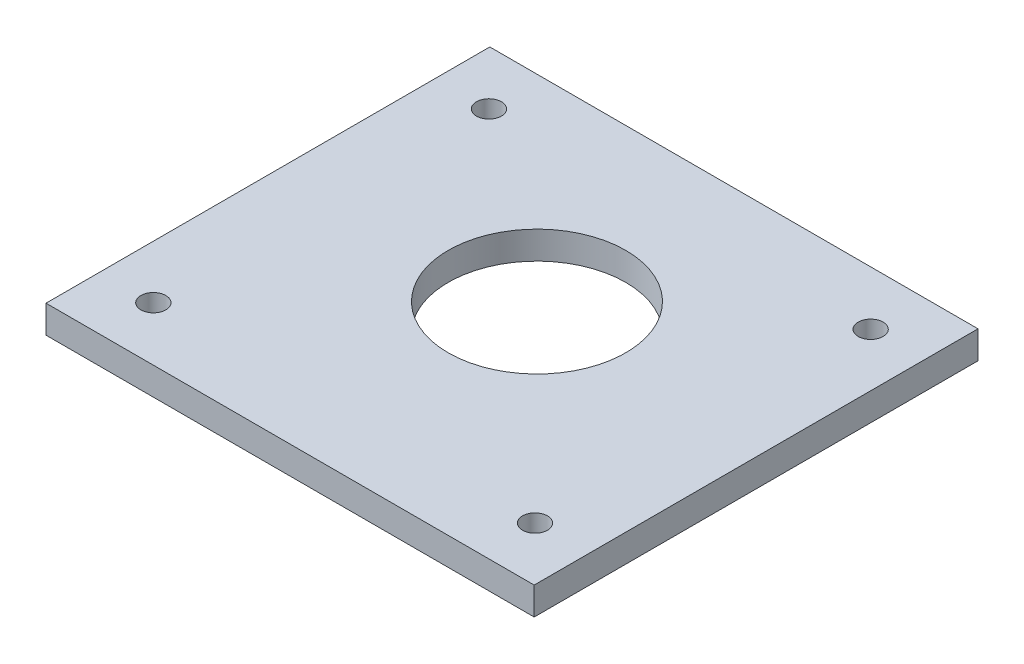
ISO-10303-21;
HEADER;
FILE_DESCRIPTION(('STEP AP214'),'2;1');
FILE_NAME('part.step','',(''),(''),'','','');
FILE_SCHEMA(('AUTOMOTIVE_DESIGN { 1 0 10303 214 1 1 1 1 }'));
ENDSEC;
DATA;
#1=APPLICATION_CONTEXT('core data for automotive mechanical design processes');
#2=APPLICATION_PROTOCOL_DEFINITION('international standard','automotive_design',2000,#1);
#3=PRODUCT_CONTEXT('',#1,'mechanical');
#4=PRODUCT('Part','Part','',(#3));
#5=PRODUCT_RELATED_PRODUCT_CATEGORY('part','',(#4));
#6=PRODUCT_DEFINITION_FORMATION('','',#4);
#7=PRODUCT_DEFINITION_CONTEXT('part definition',#1,'design');
#8=PRODUCT_DEFINITION('design','',#6,#7);
#9=PRODUCT_DEFINITION_SHAPE('','',#8);
#10=(LENGTH_UNIT() NAMED_UNIT(*) SI_UNIT(.MILLI.,.METRE.));
#11=(NAMED_UNIT(*) PLANE_ANGLE_UNIT() SI_UNIT($,.RADIAN.));
#12=(NAMED_UNIT(*) SI_UNIT($,.STERADIAN.) SOLID_ANGLE_UNIT());
#13=UNCERTAINTY_MEASURE_WITH_UNIT(LENGTH_MEASURE(1.E-05),#10,'distance_accuracy_value','');
#14=(GEOMETRIC_REPRESENTATION_CONTEXT(3) GLOBAL_UNCERTAINTY_ASSIGNED_CONTEXT((#13)) GLOBAL_UNIT_ASSIGNED_CONTEXT((#10,
#11,#12)) REPRESENTATION_CONTEXT('',''));
#15=CARTESIAN_POINT('',(0.,0.,0.));
#16=DIRECTION('',(0.,0.,1.));
#17=DIRECTION('',(1.,0.,0.));
#18=AXIS2_PLACEMENT_3D('',#15,#16,#17);
#19=CARTESIAN_POINT('',(0.,5.,0.));
#20=DIRECTION('',(0.,1.,0.));
#21=DIRECTION('',(0.,0.,1.));
#22=AXIS2_PLACEMENT_3D('',#19,#20,#21);
#23=PLANE('',#22);
#24=CARTESIAN_POINT('',(-34.4,5.,30.25));
#25=DIRECTION('',(0.,1.,0.));
#26=DIRECTION('',(0.,0.,1.));
#27=AXIS2_PLACEMENT_3D('',#24,#25,#26);
#28=CIRCLE('',#27,2.25);
#29=CARTESIAN_POINT('',(-34.4,5.,32.5));
#30=VERTEX_POINT('',#29);
#31=EDGE_CURVE('E132',#30,#30,#28,.T.);
#32=ORIENTED_EDGE('',*,*,#31,.F.);
#33=EDGE_LOOP('',(#32));
#34=FACE_BOUND('',#33,.T.);
#35=CARTESIAN_POINT('',(34.4,5.,-30.25));
#36=DIRECTION('',(0.,1.,0.));
#37=DIRECTION('',(0.,0.,1.));
#38=AXIS2_PLACEMENT_3D('',#35,#36,#37);
#39=CIRCLE('',#38,2.25);
#40=CARTESIAN_POINT('',(34.4,5.,-28.));
#41=VERTEX_POINT('',#40);
#42=EDGE_CURVE('E120',#41,#41,#39,.T.);
#43=ORIENTED_EDGE('',*,*,#42,.F.);
#44=EDGE_LOOP('',(#43));
#45=FACE_BOUND('',#44,.T.);
#46=DIRECTION('',(0.,0.,-1.));
#47=VECTOR('',#46,1.);
#48=CARTESIAN_POINT('',(44.,5.,-40.));
#49=LINE('',#48,#47);
#50=CARTESIAN_POINT('',(44.,5.,40.));
#51=VERTEX_POINT('',#50);
#52=CARTESIAN_POINT('',(44.,5.,-40.));
#53=VERTEX_POINT('',#52);
#54=EDGE_CURVE('E90',#51,#53,#49,.T.);
#55=ORIENTED_EDGE('',*,*,#54,.T.);
#56=DIRECTION('',(-1.,0.,0.));
#57=VECTOR('',#56,1.);
#58=CARTESIAN_POINT('',(-44.,5.,-40.));
#59=LINE('',#58,#57);
#60=CARTESIAN_POINT('',(-44.,5.,-40.));
#61=VERTEX_POINT('',#60);
#62=EDGE_CURVE('E85',#53,#61,#59,.T.);
#63=ORIENTED_EDGE('',*,*,#62,.T.);
#64=DIRECTION('',(0.,0.,1.));
#65=VECTOR('',#64,1.);
#66=CARTESIAN_POINT('',(-44.,5.,-40.));
#67=LINE('',#66,#65);
#68=CARTESIAN_POINT('',(-44.,5.,40.));
#69=VERTEX_POINT('',#68);
#70=EDGE_CURVE('E88',#61,#69,#67,.T.);
#71=ORIENTED_EDGE('',*,*,#70,.T.);
#72=DIRECTION('',(1.,0.,0.));
#73=VECTOR('',#72,1.);
#74=CARTESIAN_POINT('',(-44.,5.,40.));
#75=LINE('',#74,#73);
#76=EDGE_CURVE('E55',#69,#51,#75,.T.);
#77=ORIENTED_EDGE('',*,*,#76,.T.);
#78=EDGE_LOOP('',(#55,#63,#71,#77));
#79=FACE_BOUND('',#78,.T.);
#80=CARTESIAN_POINT('',(-34.4,5.,-30.25));
#81=DIRECTION('',(0.,1.,0.));
#82=DIRECTION('',(0.,0.,1.));
#83=AXIS2_PLACEMENT_3D('',#80,#81,#82);
#84=CIRCLE('',#83,2.25);
#85=CARTESIAN_POINT('',(-34.4,5.,-28.));
#86=VERTEX_POINT('',#85);
#87=EDGE_CURVE('E105',#86,#86,#84,.T.);
#88=ORIENTED_EDGE('',*,*,#87,.F.);
#89=EDGE_LOOP('',(#88));
#90=FACE_BOUND('',#89,.T.);
#91=CARTESIAN_POINT('',(34.4,5.,30.25));
#92=DIRECTION('',(0.,1.,0.));
#93=DIRECTION('',(0.,0.,1.));
#94=AXIS2_PLACEMENT_3D('',#91,#92,#93);
#95=CIRCLE('',#94,2.25);
#96=CARTESIAN_POINT('',(34.4,5.,32.5));
#97=VERTEX_POINT('',#96);
#98=EDGE_CURVE('E126',#97,#97,#95,.T.);
#99=ORIENTED_EDGE('',*,*,#98,.F.);
#100=EDGE_LOOP('',(#99));
#101=FACE_BOUND('',#100,.T.);
#102=CARTESIAN_POINT('',(0.,5.,-4.5));
#103=DIRECTION('',(0.,1.,0.));
#104=DIRECTION('',(0.,0.,1.));
#105=AXIS2_PLACEMENT_3D('',#102,#103,#104);
#106=CIRCLE('',#105,16.);
#107=CARTESIAN_POINT('',(0.,5.,11.5));
#108=VERTEX_POINT('',#107);
#109=EDGE_CURVE('E138',#108,#108,#106,.T.);
#110=ORIENTED_EDGE('',*,*,#109,.F.);
#111=EDGE_LOOP('',(#110));
#112=FACE_BOUND('',#111,.T.);
#113=ADVANCED_FACE('F38',(#34,#45,#79,#90,#101,#112),#23,.T.);
#114=CARTESIAN_POINT('',(0.,0.,0.));
#115=DIRECTION('',(0.,1.,0.));
#116=DIRECTION('',(0.,0.,1.));
#117=AXIS2_PLACEMENT_3D('',#114,#115,#116);
#118=PLANE('',#117);
#119=DIRECTION('',(0.,0.,-1.));
#120=VECTOR('',#119,1.);
#121=CARTESIAN_POINT('',(44.,0.,-40.));
#122=LINE('',#121,#120);
#123=CARTESIAN_POINT('',(44.,0.,40.));
#124=VERTEX_POINT('',#123);
#125=CARTESIAN_POINT('',(44.,0.,-40.));
#126=VERTEX_POINT('',#125);
#127=EDGE_CURVE('E102',#124,#126,#122,.T.);
#128=ORIENTED_EDGE('',*,*,#127,.F.);
#129=DIRECTION('',(1.,0.,0.));
#130=VECTOR('',#129,1.);
#131=CARTESIAN_POINT('',(-44.,0.,40.));
#132=LINE('',#131,#130);
#133=CARTESIAN_POINT('',(-44.,0.,40.));
#134=VERTEX_POINT('',#133);
#135=EDGE_CURVE('E78',#134,#124,#132,.T.);
#136=ORIENTED_EDGE('',*,*,#135,.F.);
#137=DIRECTION('',(0.,0.,1.));
#138=VECTOR('',#137,1.);
#139=CARTESIAN_POINT('',(-44.,0.,-40.));
#140=LINE('',#139,#138);
#141=CARTESIAN_POINT('',(-44.,0.,-40.));
#142=VERTEX_POINT('',#141);
#143=EDGE_CURVE('E72',#142,#134,#140,.T.);
#144=ORIENTED_EDGE('',*,*,#143,.F.);
#145=DIRECTION('',(-1.,0.,0.));
#146=VECTOR('',#145,1.);
#147=CARTESIAN_POINT('',(-44.,0.,-40.));
#148=LINE('',#147,#146);
#149=EDGE_CURVE('E94',#126,#142,#148,.T.);
#150=ORIENTED_EDGE('',*,*,#149,.F.);
#151=EDGE_LOOP('',(#128,#136,#144,#150));
#152=FACE_BOUND('',#151,.T.);
#153=CARTESIAN_POINT('',(-34.4,0.,-30.25));
#154=DIRECTION('',(0.,1.,0.));
#155=DIRECTION('',(0.,0.,1.));
#156=AXIS2_PLACEMENT_3D('',#153,#154,#155);
#157=CIRCLE('',#156,2.25);
#158=CARTESIAN_POINT('',(-34.4,0.,-28.));
#159=VERTEX_POINT('',#158);
#160=EDGE_CURVE('E117',#159,#159,#157,.T.);
#161=ORIENTED_EDGE('',*,*,#160,.T.);
#162=EDGE_LOOP('',(#161));
#163=FACE_BOUND('',#162,.T.);
#164=CARTESIAN_POINT('',(34.4,0.,-30.25));
#165=DIRECTION('',(0.,1.,0.));
#166=DIRECTION('',(0.,0.,1.));
#167=AXIS2_PLACEMENT_3D('',#164,#165,#166);
#168=CIRCLE('',#167,2.25);
#169=CARTESIAN_POINT('',(34.4,0.,-28.));
#170=VERTEX_POINT('',#169);
#171=EDGE_CURVE('E123',#170,#170,#168,.T.);
#172=ORIENTED_EDGE('',*,*,#171,.T.);
#173=EDGE_LOOP('',(#172));
#174=FACE_BOUND('',#173,.T.);
#175=CARTESIAN_POINT('',(34.4,0.,30.25));
#176=DIRECTION('',(0.,1.,0.));
#177=DIRECTION('',(0.,0.,1.));
#178=AXIS2_PLACEMENT_3D('',#175,#176,#177);
#179=CIRCLE('',#178,2.25);
#180=CARTESIAN_POINT('',(34.4,0.,32.5));
#181=VERTEX_POINT('',#180);
#182=EDGE_CURVE('E129',#181,#181,#179,.T.);
#183=ORIENTED_EDGE('',*,*,#182,.T.);
#184=EDGE_LOOP('',(#183));
#185=FACE_BOUND('',#184,.T.);
#186=CARTESIAN_POINT('',(-34.4,0.,30.25));
#187=DIRECTION('',(0.,1.,0.));
#188=DIRECTION('',(0.,0.,1.));
#189=AXIS2_PLACEMENT_3D('',#186,#187,#188);
#190=CIRCLE('',#189,2.25);
#191=CARTESIAN_POINT('',(-34.4,0.,32.5));
#192=VERTEX_POINT('',#191);
#193=EDGE_CURVE('E135',#192,#192,#190,.T.);
#194=ORIENTED_EDGE('',*,*,#193,.T.);
#195=EDGE_LOOP('',(#194));
#196=FACE_BOUND('',#195,.T.);
#197=CARTESIAN_POINT('',(0.,0.,-4.5));
#198=DIRECTION('',(0.,1.,0.));
#199=DIRECTION('',(0.,0.,1.));
#200=AXIS2_PLACEMENT_3D('',#197,#198,#199);
#201=CIRCLE('',#200,16.);
#202=CARTESIAN_POINT('',(0.,0.,11.5));
#203=VERTEX_POINT('',#202);
#204=EDGE_CURVE('E141',#203,#203,#201,.T.);
#205=ORIENTED_EDGE('',*,*,#204,.T.);
#206=EDGE_LOOP('',(#205));
#207=FACE_BOUND('',#206,.T.);
#208=ADVANCED_FACE('F113',(#152,#163,#174,#185,#196,#207),#118,.F.);
#209=CARTESIAN_POINT('',(44.,5.,-40.));
#210=DIRECTION('',(-1.,0.,0.));
#211=DIRECTION('',(0.,0.,1.));
#212=AXIS2_PLACEMENT_3D('',#209,#210,#211);
#213=PLANE('',#212);
#214=ORIENTED_EDGE('',*,*,#127,.T.);
#215=DIRECTION('',(0.,-1.,0.));
#216=VECTOR('',#215,1.);
#217=CARTESIAN_POINT('',(44.,5.,-40.));
#218=LINE('',#217,#216);
#219=EDGE_CURVE('E11',#53,#126,#218,.T.);
#220=ORIENTED_EDGE('',*,*,#219,.F.);
#221=ORIENTED_EDGE('',*,*,#54,.F.);
#222=DIRECTION('',(0.,-1.,0.));
#223=VECTOR('',#222,1.);
#224=CARTESIAN_POINT('',(44.,5.,40.));
#225=LINE('',#224,#223);
#226=EDGE_CURVE('E98',#51,#124,#225,.T.);
#227=ORIENTED_EDGE('',*,*,#226,.T.);
#228=EDGE_LOOP('',(#214,#220,#221,#227));
#229=FACE_BOUND('',#228,.T.);
#230=ADVANCED_FACE('F40',(#229),#213,.F.);
#231=CARTESIAN_POINT('',(-44.,5.,-40.));
#232=DIRECTION('',(0.,0.,1.));
#233=DIRECTION('',(1.,0.,0.));
#234=AXIS2_PLACEMENT_3D('',#231,#232,#233);
#235=PLANE('',#234);
#236=ORIENTED_EDGE('',*,*,#149,.T.);
#237=DIRECTION('',(0.,-1.,0.));
#238=VECTOR('',#237,1.);
#239=CARTESIAN_POINT('',(-44.,5.,-40.));
#240=LINE('',#239,#238);
#241=EDGE_CURVE('E47',#61,#142,#240,.T.);
#242=ORIENTED_EDGE('',*,*,#241,.F.);
#243=ORIENTED_EDGE('',*,*,#62,.F.);
#244=ORIENTED_EDGE('',*,*,#219,.T.);
#245=EDGE_LOOP('',(#236,#242,#243,#244));
#246=FACE_BOUND('',#245,.T.);
#247=ADVANCED_FACE('F93',(#246),#235,.F.);
#248=CARTESIAN_POINT('',(-44.,5.,-40.));
#249=DIRECTION('',(1.,0.,0.));
#250=DIRECTION('',(0.,0.,-1.));
#251=AXIS2_PLACEMENT_3D('',#248,#249,#250);
#252=PLANE('',#251);
#253=ORIENTED_EDGE('',*,*,#143,.T.);
#254=DIRECTION('',(0.,-1.,0.));
#255=VECTOR('',#254,1.);
#256=CARTESIAN_POINT('',(-44.,5.,40.));
#257=LINE('',#256,#255);
#258=EDGE_CURVE('E95',#69,#134,#257,.T.);
#259=ORIENTED_EDGE('',*,*,#258,.F.);
#260=ORIENTED_EDGE('',*,*,#70,.F.);
#261=ORIENTED_EDGE('',*,*,#241,.T.);
#262=EDGE_LOOP('',(#253,#259,#260,#261));
#263=FACE_BOUND('',#262,.T.);
#264=ADVANCED_FACE('F96',(#263),#252,.F.);
#265=CARTESIAN_POINT('',(-44.,5.,40.));
#266=DIRECTION('',(0.,0.,-1.));
#267=DIRECTION('',(-1.,0.,0.));
#268=AXIS2_PLACEMENT_3D('',#265,#266,#267);
#269=PLANE('',#268);
#270=ORIENTED_EDGE('',*,*,#135,.T.);
#271=ORIENTED_EDGE('',*,*,#226,.F.);
#272=ORIENTED_EDGE('',*,*,#76,.F.);
#273=ORIENTED_EDGE('',*,*,#258,.T.);
#274=EDGE_LOOP('',(#270,#271,#272,#273));
#275=FACE_BOUND('',#274,.T.);
#276=ADVANCED_FACE('F110',(#275),#269,.F.);
#277=CARTESIAN_POINT('',(-34.4,5.,-30.25));
#278=DIRECTION('',(0.,-1.,0.));
#279=DIRECTION('',(0.,0.,-1.));
#280=AXIS2_PLACEMENT_3D('',#277,#278,#279);
#281=CYLINDRICAL_SURFACE('',#280,2.25);
#282=ORIENTED_EDGE('',*,*,#87,.T.);
#283=EDGE_LOOP('',(#282));
#284=FACE_BOUND('',#283,.T.);
#285=ORIENTED_EDGE('',*,*,#160,.F.);
#286=EDGE_LOOP('',(#285));
#287=FACE_BOUND('',#286,.T.);
#288=ADVANCED_FACE('F160',(#284,#287),#281,.F.);
#289=CARTESIAN_POINT('',(34.4,5.,-30.25));
#290=DIRECTION('',(0.,-1.,0.));
#291=DIRECTION('',(0.,0.,-1.));
#292=AXIS2_PLACEMENT_3D('',#289,#290,#291);
#293=CYLINDRICAL_SURFACE('',#292,2.25);
#294=ORIENTED_EDGE('',*,*,#42,.T.);
#295=EDGE_LOOP('',(#294));
#296=FACE_BOUND('',#295,.T.);
#297=ORIENTED_EDGE('',*,*,#171,.F.);
#298=EDGE_LOOP('',(#297));
#299=FACE_BOUND('',#298,.T.);
#300=ADVANCED_FACE('F214',(#296,#299),#293,.F.);
#301=CARTESIAN_POINT('',(34.4,5.,30.25));
#302=DIRECTION('',(0.,-1.,0.));
#303=DIRECTION('',(0.,0.,-1.));
#304=AXIS2_PLACEMENT_3D('',#301,#302,#303);
#305=CYLINDRICAL_SURFACE('',#304,2.25);
#306=ORIENTED_EDGE('',*,*,#98,.T.);
#307=EDGE_LOOP('',(#306));
#308=FACE_BOUND('',#307,.T.);
#309=ORIENTED_EDGE('',*,*,#182,.F.);
#310=EDGE_LOOP('',(#309));
#311=FACE_BOUND('',#310,.T.);
#312=ADVANCED_FACE('F223',(#308,#311),#305,.F.);
#313=CARTESIAN_POINT('',(-34.4,5.,30.25));
#314=DIRECTION('',(0.,-1.,0.));
#315=DIRECTION('',(0.,0.,-1.));
#316=AXIS2_PLACEMENT_3D('',#313,#314,#315);
#317=CYLINDRICAL_SURFACE('',#316,2.25);
#318=ORIENTED_EDGE('',*,*,#31,.T.);
#319=EDGE_LOOP('',(#318));
#320=FACE_BOUND('',#319,.T.);
#321=ORIENTED_EDGE('',*,*,#193,.F.);
#322=EDGE_LOOP('',(#321));
#323=FACE_BOUND('',#322,.T.);
#324=ADVANCED_FACE('F232',(#320,#323),#317,.F.);
#325=CARTESIAN_POINT('',(0.,5.,-4.5));
#326=DIRECTION('',(0.,-1.,0.));
#327=DIRECTION('',(0.,0.,-1.));
#328=AXIS2_PLACEMENT_3D('',#325,#326,#327);
#329=CYLINDRICAL_SURFACE('',#328,16.);
#330=ORIENTED_EDGE('',*,*,#109,.T.);
#331=EDGE_LOOP('',(#330));
#332=FACE_BOUND('',#331,.T.);
#333=ORIENTED_EDGE('',*,*,#204,.F.);
#334=EDGE_LOOP('',(#333));
#335=FACE_BOUND('',#334,.T.);
#336=ADVANCED_FACE('F147',(#332,#335),#329,.F.);
#337=CLOSED_SHELL('',(#113,#208,#230,#247,#264,#276,#288,#300,#312,#324,#336));
#338=MANIFOLD_SOLID_BREP('B2',#337);
#339=ADVANCED_BREP_SHAPE_REPRESENTATION('',(#18,#338),#14);
#340=SHAPE_DEFINITION_REPRESENTATION(#9,#339);
ENDSEC;
END-ISO-10303-21;
